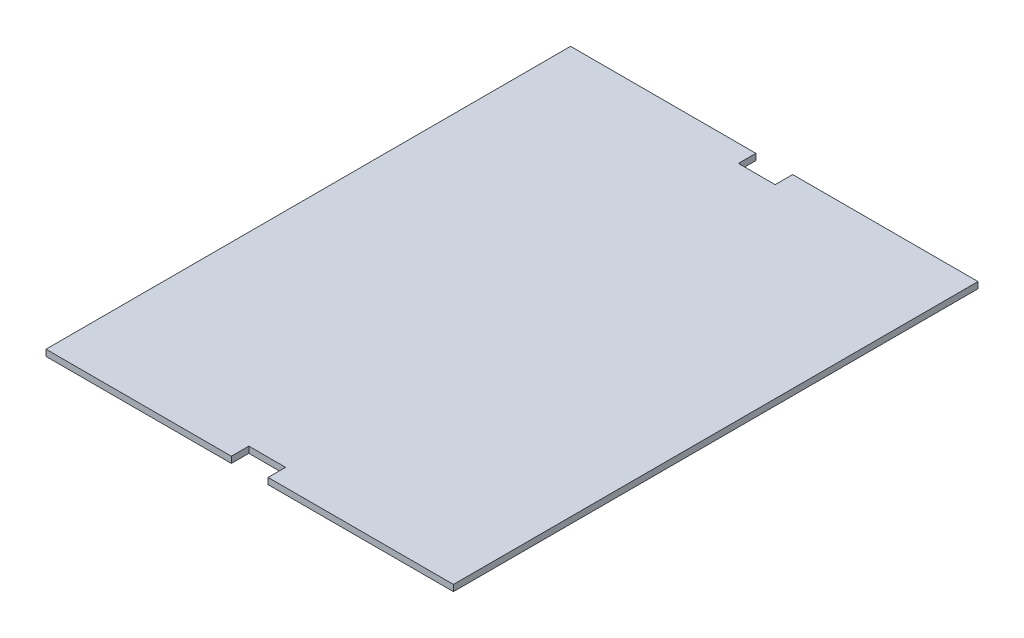
ISO-10303-21;
HEADER;
FILE_DESCRIPTION(('STEP AP214'),'2;1');
FILE_NAME('part.step','',(''),(''),'','','');
FILE_SCHEMA(('AUTOMOTIVE_DESIGN { 1 0 10303 214 1 1 1 1 }'));
ENDSEC;
DATA;
#1=APPLICATION_CONTEXT('core data for automotive mechanical design processes');
#2=APPLICATION_PROTOCOL_DEFINITION('international standard','automotive_design',2000,#1);
#3=PRODUCT_CONTEXT('',#1,'mechanical');
#4=PRODUCT('Part','Part','',(#3));
#5=PRODUCT_RELATED_PRODUCT_CATEGORY('part','',(#4));
#6=PRODUCT_DEFINITION_FORMATION('','',#4);
#7=PRODUCT_DEFINITION_CONTEXT('part definition',#1,'design');
#8=PRODUCT_DEFINITION('design','',#6,#7);
#9=PRODUCT_DEFINITION_SHAPE('','',#8);
#10=(LENGTH_UNIT() NAMED_UNIT(*) SI_UNIT(.MILLI.,.METRE.));
#11=(NAMED_UNIT(*) PLANE_ANGLE_UNIT() SI_UNIT($,.RADIAN.));
#12=(NAMED_UNIT(*) SI_UNIT($,.STERADIAN.) SOLID_ANGLE_UNIT());
#13=UNCERTAINTY_MEASURE_WITH_UNIT(LENGTH_MEASURE(1.E-05),#10,'distance_accuracy_value','');
#14=(GEOMETRIC_REPRESENTATION_CONTEXT(3) GLOBAL_UNCERTAINTY_ASSIGNED_CONTEXT((#13)) GLOBAL_UNIT_ASSIGNED_CONTEXT((#10,
#11,#12)) REPRESENTATION_CONTEXT('',''));
#15=CARTESIAN_POINT('',(0.,0.,0.));
#16=DIRECTION('',(0.,0.,1.));
#17=DIRECTION('',(1.,0.,0.));
#18=AXIS2_PLACEMENT_3D('',#15,#16,#17);
#19=CARTESIAN_POINT('',(-58.25,1.8,-75.));
#20=DIRECTION('',(0.,0.,1.));
#21=DIRECTION('',(1.,0.,0.));
#22=AXIS2_PLACEMENT_3D('',#19,#20,#21);
#23=PLANE('',#22);
#24=DIRECTION('',(-1.,0.,0.));
#25=VECTOR('',#24,1.);
#26=CARTESIAN_POINT('',(-58.25,0.,-75.));
#27=LINE('',#26,#25);
#28=CARTESIAN_POINT('',(58.25,0.,-75.));
#29=VERTEX_POINT('',#28);
#30=CARTESIAN_POINT('',(5.25,0.,-75.));
#31=VERTEX_POINT('',#30);
#32=EDGE_CURVE('E171',#29,#31,#27,.T.);
#33=ORIENTED_EDGE('',*,*,#32,.T.);
#34=DIRECTION('',(0.,1.,0.));
#35=VECTOR('',#34,1.);
#36=CARTESIAN_POINT('',(5.25,0.,-75.));
#37=LINE('',#36,#35);
#38=CARTESIAN_POINT('',(5.25,1.8,-75.));
#39=VERTEX_POINT('',#38);
#40=EDGE_CURVE('E193',#31,#39,#37,.T.);
#41=ORIENTED_EDGE('',*,*,#40,.T.);
#42=DIRECTION('',(-1.,0.,0.));
#43=VECTOR('',#42,1.);
#44=CARTESIAN_POINT('',(-58.25,1.8,-75.));
#45=LINE('',#44,#43);
#46=CARTESIAN_POINT('',(58.25,1.8,-75.));
#47=VERTEX_POINT('',#46);
#48=EDGE_CURVE('E183',#47,#39,#45,.T.);
#49=ORIENTED_EDGE('',*,*,#48,.F.);
#50=DIRECTION('',(0.,-1.,0.));
#51=VECTOR('',#50,1.);
#52=CARTESIAN_POINT('',(58.25,1.8,-75.));
#53=LINE('',#52,#51);
#54=EDGE_CURVE('E11',#47,#29,#53,.T.);
#55=ORIENTED_EDGE('',*,*,#54,.T.);
#56=EDGE_LOOP('',(#33,#41,#49,#55));
#57=FACE_BOUND('',#56,.T.);
#58=ADVANCED_FACE('F32',(#57),#23,.F.);
#59=CARTESIAN_POINT('',(-58.25,1.8,75.));
#60=DIRECTION('',(0.,0.,-1.));
#61=DIRECTION('',(-1.,0.,0.));
#62=AXIS2_PLACEMENT_3D('',#59,#60,#61);
#63=PLANE('',#62);
#64=DIRECTION('',(1.,0.,0.));
#65=VECTOR('',#64,1.);
#66=CARTESIAN_POINT('',(-58.25,0.,75.));
#67=LINE('',#66,#65);
#68=CARTESIAN_POINT('',(-58.25,0.,75.));
#69=VERTEX_POINT('',#68);
#70=CARTESIAN_POINT('',(-5.25000000000001,0.,75.));
#71=VERTEX_POINT('',#70);
#72=EDGE_CURVE('E137',#69,#71,#67,.T.);
#73=ORIENTED_EDGE('',*,*,#72,.T.);
#74=DIRECTION('',(0.,1.,0.));
#75=VECTOR('',#74,1.);
#76=CARTESIAN_POINT('',(-5.25000000000001,0.,75.));
#77=LINE('',#76,#75);
#78=CARTESIAN_POINT('',(-5.25000000000001,1.8,75.));
#79=VERTEX_POINT('',#78);
#80=EDGE_CURVE('E121',#71,#79,#77,.T.);
#81=ORIENTED_EDGE('',*,*,#80,.T.);
#82=DIRECTION('',(1.,0.,0.));
#83=VECTOR('',#82,1.);
#84=CARTESIAN_POINT('',(-58.25,1.8,75.));
#85=LINE('',#84,#83);
#86=CARTESIAN_POINT('',(-58.25,1.8,75.));
#87=VERTEX_POINT('',#86);
#88=EDGE_CURVE('E159',#87,#79,#85,.T.);
#89=ORIENTED_EDGE('',*,*,#88,.F.);
#90=DIRECTION('',(0.,-1.,0.));
#91=VECTOR('',#90,1.);
#92=CARTESIAN_POINT('',(-58.25,1.8,75.));
#93=LINE('',#92,#91);
#94=EDGE_CURVE('E145',#87,#69,#93,.T.);
#95=ORIENTED_EDGE('',*,*,#94,.T.);
#96=EDGE_LOOP('',(#73,#81,#89,#95));
#97=FACE_BOUND('',#96,.T.);
#98=ADVANCED_FACE('F143',(#97),#63,.F.);
#99=CARTESIAN_POINT('',(58.25,1.8,75.));
#100=DIRECTION('',(-1.,0.,0.));
#101=DIRECTION('',(0.,0.,1.));
#102=AXIS2_PLACEMENT_3D('',#99,#100,#101);
#103=PLANE('',#102);
#104=DIRECTION('',(0.,0.,-1.));
#105=VECTOR('',#104,1.);
#106=CARTESIAN_POINT('',(58.25,0.,75.));
#107=LINE('',#106,#105);
#108=CARTESIAN_POINT('',(58.25,0.,75.));
#109=VERTEX_POINT('',#108);
#110=EDGE_CURVE('E175',#109,#29,#107,.T.);
#111=ORIENTED_EDGE('',*,*,#110,.T.);
#112=ORIENTED_EDGE('',*,*,#54,.F.);
#113=DIRECTION('',(0.,0.,-1.));
#114=VECTOR('',#113,1.);
#115=CARTESIAN_POINT('',(58.25,1.8,75.));
#116=LINE('',#115,#114);
#117=CARTESIAN_POINT('',(58.25,1.8,75.));
#118=VERTEX_POINT('',#117);
#119=EDGE_CURVE('E146',#118,#47,#116,.T.);
#120=ORIENTED_EDGE('',*,*,#119,.F.);
#121=DIRECTION('',(0.,-1.,0.));
#122=VECTOR('',#121,1.);
#123=CARTESIAN_POINT('',(58.25,1.8,75.));
#124=LINE('',#123,#122);
#125=EDGE_CURVE('E156',#118,#109,#124,.T.);
#126=ORIENTED_EDGE('',*,*,#125,.T.);
#127=EDGE_LOOP('',(#111,#112,#120,#126));
#128=FACE_BOUND('',#127,.T.);
#129=ADVANCED_FACE('F34',(#128),#103,.F.);
#130=CARTESIAN_POINT('',(-5.25000000000001,1.8,-75.));
#131=VERTEX_POINT('',#130);
#132=CARTESIAN_POINT('',(-58.25,1.8,-75.));
#133=VERTEX_POINT('',#132);
#134=EDGE_CURVE('E150',#131,#133,#45,.T.);
#135=ORIENTED_EDGE('',*,*,#134,.F.);
#136=DIRECTION('',(0.,1.,0.));
#137=VECTOR('',#136,1.);
#138=CARTESIAN_POINT('',(-5.25000000000001,0.,-75.));
#139=LINE('',#138,#137);
#140=CARTESIAN_POINT('',(-5.25000000000001,0.,-75.));
#141=VERTEX_POINT('',#140);
#142=EDGE_CURVE('E186',#141,#131,#139,.T.);
#143=ORIENTED_EDGE('',*,*,#142,.F.);
#144=CARTESIAN_POINT('',(-58.25,0.,-75.));
#145=VERTEX_POINT('',#144);
#146=EDGE_CURVE('E170',#141,#145,#27,.T.);
#147=ORIENTED_EDGE('',*,*,#146,.T.);
#148=DIRECTION('',(0.,-1.,0.));
#149=VECTOR('',#148,1.);
#150=CARTESIAN_POINT('',(-58.25,1.8,-75.));
#151=LINE('',#150,#149);
#152=EDGE_CURVE('E40',#133,#145,#151,.T.);
#153=ORIENTED_EDGE('',*,*,#152,.F.);
#154=EDGE_LOOP('',(#135,#143,#147,#153));
#155=FACE_BOUND('',#154,.T.);
#156=ADVANCED_FACE('F245',(#155),#23,.F.);
#157=CARTESIAN_POINT('',(-58.25,1.8,75.));
#158=DIRECTION('',(1.,0.,0.));
#159=DIRECTION('',(0.,0.,-1.));
#160=AXIS2_PLACEMENT_3D('',#157,#158,#159);
#161=PLANE('',#160);
#162=DIRECTION('',(0.,0.,1.));
#163=VECTOR('',#162,1.);
#164=CARTESIAN_POINT('',(-58.25,0.,75.));
#165=LINE('',#164,#163);
#166=EDGE_CURVE('E152',#145,#69,#165,.T.);
#167=ORIENTED_EDGE('',*,*,#166,.T.);
#168=ORIENTED_EDGE('',*,*,#94,.F.);
#169=DIRECTION('',(0.,0.,1.));
#170=VECTOR('',#169,1.);
#171=CARTESIAN_POINT('',(-58.25,1.8,75.));
#172=LINE('',#171,#170);
#173=EDGE_CURVE('E165',#133,#87,#172,.T.);
#174=ORIENTED_EDGE('',*,*,#173,.F.);
#175=ORIENTED_EDGE('',*,*,#152,.T.);
#176=EDGE_LOOP('',(#167,#168,#174,#175));
#177=FACE_BOUND('',#176,.T.);
#178=ADVANCED_FACE('F164',(#177),#161,.F.);
#179=CARTESIAN_POINT('',(5.25,1.8,75.));
#180=VERTEX_POINT('',#179);
#181=EDGE_CURVE('E181',#180,#118,#85,.T.);
#182=ORIENTED_EDGE('',*,*,#181,.F.);
#183=DIRECTION('',(0.,1.,0.));
#184=VECTOR('',#183,1.);
#185=CARTESIAN_POINT('',(5.25,0.,75.));
#186=LINE('',#185,#184);
#187=CARTESIAN_POINT('',(5.25,0.,75.));
#188=VERTEX_POINT('',#187);
#189=EDGE_CURVE('E131',#188,#180,#186,.T.);
#190=ORIENTED_EDGE('',*,*,#189,.F.);
#191=EDGE_CURVE('E147',#188,#109,#67,.T.);
#192=ORIENTED_EDGE('',*,*,#191,.T.);
#193=ORIENTED_EDGE('',*,*,#125,.F.);
#194=EDGE_LOOP('',(#182,#190,#192,#193));
#195=FACE_BOUND('',#194,.T.);
#196=ADVANCED_FACE('F227',(#195),#63,.F.);
#197=CARTESIAN_POINT('',(0.,1.8,0.));
#198=DIRECTION('',(0.,-1.,0.));
#199=DIRECTION('',(0.,0.,-1.));
#200=AXIS2_PLACEMENT_3D('',#197,#198,#199);
#201=PLANE('',#200);
#202=ORIENTED_EDGE('',*,*,#88,.T.);
#203=DIRECTION('',(0.,0.,1.));
#204=VECTOR('',#203,1.);
#205=CARTESIAN_POINT('',(-5.25000000000001,1.8,75.));
#206=LINE('',#205,#204);
#207=CARTESIAN_POINT('',(-5.25000000000001,1.8,70.));
#208=VERTEX_POINT('',#207);
#209=EDGE_CURVE('E126',#208,#79,#206,.T.);
#210=ORIENTED_EDGE('',*,*,#209,.F.);
#211=DIRECTION('',(-1.,0.,0.));
#212=VECTOR('',#211,1.);
#213=CARTESIAN_POINT('',(-5.25000000000001,1.8,70.));
#214=LINE('',#213,#212);
#215=CARTESIAN_POINT('',(5.25,1.8,70.));
#216=VERTEX_POINT('',#215);
#217=EDGE_CURVE('E140',#216,#208,#214,.T.);
#218=ORIENTED_EDGE('',*,*,#217,.F.);
#219=DIRECTION('',(0.,0.,-1.));
#220=VECTOR('',#219,1.);
#221=CARTESIAN_POINT('',(5.25,1.8,75.));
#222=LINE('',#221,#220);
#223=EDGE_CURVE('E214',#180,#216,#222,.T.);
#224=ORIENTED_EDGE('',*,*,#223,.F.);
#225=ORIENTED_EDGE('',*,*,#181,.T.);
#226=ORIENTED_EDGE('',*,*,#119,.T.);
#227=ORIENTED_EDGE('',*,*,#48,.T.);
#228=DIRECTION('',(0.,0.,-1.));
#229=VECTOR('',#228,1.);
#230=CARTESIAN_POINT('',(5.25,1.8,-75.));
#231=LINE('',#230,#229);
#232=CARTESIAN_POINT('',(5.25,1.8,-70.));
#233=VERTEX_POINT('',#232);
#234=EDGE_CURVE('E195',#233,#39,#231,.T.);
#235=ORIENTED_EDGE('',*,*,#234,.F.);
#236=DIRECTION('',(1.,0.,0.));
#237=VECTOR('',#236,1.);
#238=CARTESIAN_POINT('',(-5.25000000000001,1.8,-70.));
#239=LINE('',#238,#237);
#240=CARTESIAN_POINT('',(-5.25000000000001,1.8,-70.));
#241=VERTEX_POINT('',#240);
#242=EDGE_CURVE('E198',#241,#233,#239,.T.);
#243=ORIENTED_EDGE('',*,*,#242,.F.);
#244=DIRECTION('',(0.,0.,1.));
#245=VECTOR('',#244,1.);
#246=CARTESIAN_POINT('',(-5.25000000000001,1.8,-75.));
#247=LINE('',#246,#245);
#248=EDGE_CURVE('E201',#131,#241,#247,.T.);
#249=ORIENTED_EDGE('',*,*,#248,.F.);
#250=ORIENTED_EDGE('',*,*,#134,.T.);
#251=ORIENTED_EDGE('',*,*,#173,.T.);
#252=EDGE_LOOP('',(#202,#210,#218,#224,#225,#226,#227,#235,#243,#249,#250,#251));
#253=FACE_BOUND('',#252,.T.);
#254=ADVANCED_FACE('F231',(#253),#201,.F.);
#255=CARTESIAN_POINT('',(0.,0.,0.));
#256=DIRECTION('',(0.,-1.,0.));
#257=DIRECTION('',(0.,0.,-1.));
#258=AXIS2_PLACEMENT_3D('',#255,#256,#257);
#259=PLANE('',#258);
#260=DIRECTION('',(0.,0.,1.));
#261=VECTOR('',#260,1.);
#262=CARTESIAN_POINT('',(-5.25000000000001,0.,75.));
#263=LINE('',#262,#261);
#264=CARTESIAN_POINT('',(-5.25000000000001,0.,70.));
#265=VERTEX_POINT('',#264);
#266=EDGE_CURVE('E124',#265,#71,#263,.T.);
#267=ORIENTED_EDGE('',*,*,#266,.T.);
#268=ORIENTED_EDGE('',*,*,#72,.F.);
#269=ORIENTED_EDGE('',*,*,#166,.F.);
#270=ORIENTED_EDGE('',*,*,#146,.F.);
#271=DIRECTION('',(0.,0.,1.));
#272=VECTOR('',#271,1.);
#273=CARTESIAN_POINT('',(-5.25000000000001,0.,-75.));
#274=LINE('',#273,#272);
#275=CARTESIAN_POINT('',(-5.25000000000001,0.,-70.));
#276=VERTEX_POINT('',#275);
#277=EDGE_CURVE('E197',#141,#276,#274,.T.);
#278=ORIENTED_EDGE('',*,*,#277,.T.);
#279=DIRECTION('',(1.,0.,0.));
#280=VECTOR('',#279,1.);
#281=CARTESIAN_POINT('',(-5.25000000000001,0.,-70.));
#282=LINE('',#281,#280);
#283=CARTESIAN_POINT('',(5.25,0.,-70.));
#284=VERTEX_POINT('',#283);
#285=EDGE_CURVE('E55',#276,#284,#282,.T.);
#286=ORIENTED_EDGE('',*,*,#285,.T.);
#287=DIRECTION('',(0.,0.,-1.));
#288=VECTOR('',#287,1.);
#289=CARTESIAN_POINT('',(5.25,0.,-75.));
#290=LINE('',#289,#288);
#291=EDGE_CURVE('E189',#284,#31,#290,.T.);
#292=ORIENTED_EDGE('',*,*,#291,.T.);
#293=ORIENTED_EDGE('',*,*,#32,.F.);
#294=ORIENTED_EDGE('',*,*,#110,.F.);
#295=ORIENTED_EDGE('',*,*,#191,.F.);
#296=DIRECTION('',(0.,0.,-1.));
#297=VECTOR('',#296,1.);
#298=CARTESIAN_POINT('',(5.25,0.,75.));
#299=LINE('',#298,#297);
#300=CARTESIAN_POINT('',(5.25,0.,70.));
#301=VERTEX_POINT('',#300);
#302=EDGE_CURVE('E139',#188,#301,#299,.T.);
#303=ORIENTED_EDGE('',*,*,#302,.T.);
#304=DIRECTION('',(-1.,0.,0.));
#305=VECTOR('',#304,1.);
#306=CARTESIAN_POINT('',(-5.25000000000001,0.,70.));
#307=LINE('',#306,#305);
#308=EDGE_CURVE('E47',#301,#265,#307,.T.);
#309=ORIENTED_EDGE('',*,*,#308,.T.);
#310=EDGE_LOOP('',(#267,#268,#269,#270,#278,#286,#292,#293,#294,#295,#303,#309));
#311=FACE_BOUND('',#310,.T.);
#312=ADVANCED_FACE('F135',(#311),#259,.T.);
#313=CARTESIAN_POINT('',(5.25,0.,-75.));
#314=DIRECTION('',(1.,0.,0.));
#315=DIRECTION('',(0.,0.,-1.));
#316=AXIS2_PLACEMENT_3D('',#313,#314,#315);
#317=PLANE('',#316);
#318=ORIENTED_EDGE('',*,*,#234,.T.);
#319=ORIENTED_EDGE('',*,*,#40,.F.);
#320=ORIENTED_EDGE('',*,*,#291,.F.);
#321=DIRECTION('',(0.,1.,0.));
#322=VECTOR('',#321,1.);
#323=CARTESIAN_POINT('',(5.25,0.,-70.));
#324=LINE('',#323,#322);
#325=EDGE_CURVE('E191',#284,#233,#324,.T.);
#326=ORIENTED_EDGE('',*,*,#325,.T.);
#327=EDGE_LOOP('',(#318,#319,#320,#326));
#328=FACE_BOUND('',#327,.T.);
#329=ADVANCED_FACE('F266',(#328),#317,.F.);
#330=CARTESIAN_POINT('',(-5.25000000000001,0.,-70.));
#331=DIRECTION('',(0.,0.,1.));
#332=DIRECTION('',(1.,0.,0.));
#333=AXIS2_PLACEMENT_3D('',#330,#331,#332);
#334=PLANE('',#333);
#335=ORIENTED_EDGE('',*,*,#242,.T.);
#336=ORIENTED_EDGE('',*,*,#325,.F.);
#337=ORIENTED_EDGE('',*,*,#285,.F.);
#338=DIRECTION('',(0.,1.,0.));
#339=VECTOR('',#338,1.);
#340=CARTESIAN_POINT('',(-5.25000000000001,0.,-70.));
#341=LINE('',#340,#339);
#342=EDGE_CURVE('E188',#276,#241,#341,.T.);
#343=ORIENTED_EDGE('',*,*,#342,.T.);
#344=EDGE_LOOP('',(#335,#336,#337,#343));
#345=FACE_BOUND('',#344,.T.);
#346=ADVANCED_FACE('F267',(#345),#334,.F.);
#347=CARTESIAN_POINT('',(-5.25000000000001,0.,-75.));
#348=DIRECTION('',(-1.,0.,0.));
#349=DIRECTION('',(0.,0.,1.));
#350=AXIS2_PLACEMENT_3D('',#347,#348,#349);
#351=PLANE('',#350);
#352=ORIENTED_EDGE('',*,*,#248,.T.);
#353=ORIENTED_EDGE('',*,*,#342,.F.);
#354=ORIENTED_EDGE('',*,*,#277,.F.);
#355=ORIENTED_EDGE('',*,*,#142,.T.);
#356=EDGE_LOOP('',(#352,#353,#354,#355));
#357=FACE_BOUND('',#356,.T.);
#358=ADVANCED_FACE('F242',(#357),#351,.F.);
#359=CARTESIAN_POINT('',(-5.25000000000001,0.,75.));
#360=DIRECTION('',(-1.,0.,0.));
#361=DIRECTION('',(0.,0.,1.));
#362=AXIS2_PLACEMENT_3D('',#359,#360,#361);
#363=PLANE('',#362);
#364=ORIENTED_EDGE('',*,*,#209,.T.);
#365=ORIENTED_EDGE('',*,*,#80,.F.);
#366=ORIENTED_EDGE('',*,*,#266,.F.);
#367=DIRECTION('',(0.,1.,0.));
#368=VECTOR('',#367,1.);
#369=CARTESIAN_POINT('',(-5.25000000000001,0.,70.));
#370=LINE('',#369,#368);
#371=EDGE_CURVE('E179',#265,#208,#370,.T.);
#372=ORIENTED_EDGE('',*,*,#371,.T.);
#373=EDGE_LOOP('',(#364,#365,#366,#372));
#374=FACE_BOUND('',#373,.T.);
#375=ADVANCED_FACE('F123',(#374),#363,.F.);
#376=CARTESIAN_POINT('',(-5.25000000000001,0.,70.));
#377=DIRECTION('',(0.,0.,-1.));
#378=DIRECTION('',(-1.,0.,0.));
#379=AXIS2_PLACEMENT_3D('',#376,#377,#378);
#380=PLANE('',#379);
#381=ORIENTED_EDGE('',*,*,#217,.T.);
#382=ORIENTED_EDGE('',*,*,#371,.F.);
#383=ORIENTED_EDGE('',*,*,#308,.F.);
#384=DIRECTION('',(0.,1.,0.));
#385=VECTOR('',#384,1.);
#386=CARTESIAN_POINT('',(5.25,0.,70.));
#387=LINE('',#386,#385);
#388=EDGE_CURVE('E209',#301,#216,#387,.T.);
#389=ORIENTED_EDGE('',*,*,#388,.T.);
#390=EDGE_LOOP('',(#381,#382,#383,#389));
#391=FACE_BOUND('',#390,.T.);
#392=ADVANCED_FACE('F234',(#391),#380,.F.);
#393=CARTESIAN_POINT('',(5.25,0.,75.));
#394=DIRECTION('',(1.,0.,0.));
#395=DIRECTION('',(0.,0.,-1.));
#396=AXIS2_PLACEMENT_3D('',#393,#394,#395);
#397=PLANE('',#396);
#398=ORIENTED_EDGE('',*,*,#223,.T.);
#399=ORIENTED_EDGE('',*,*,#388,.F.);
#400=ORIENTED_EDGE('',*,*,#302,.F.);
#401=ORIENTED_EDGE('',*,*,#189,.T.);
#402=EDGE_LOOP('',(#398,#399,#400,#401));
#403=FACE_BOUND('',#402,.T.);
#404=ADVANCED_FACE('F223',(#403),#397,.F.);
#405=CLOSED_SHELL('',(#58,#98,#129,#156,#178,#196,#254,#312,#329,#346,#358,#375,#392,#404));
#406=MANIFOLD_SOLID_BREP('B2',#405);
#407=ADVANCED_BREP_SHAPE_REPRESENTATION('',(#18,#406),#14);
#408=SHAPE_DEFINITION_REPRESENTATION(#9,#407);
ENDSEC;
END-ISO-10303-21;
